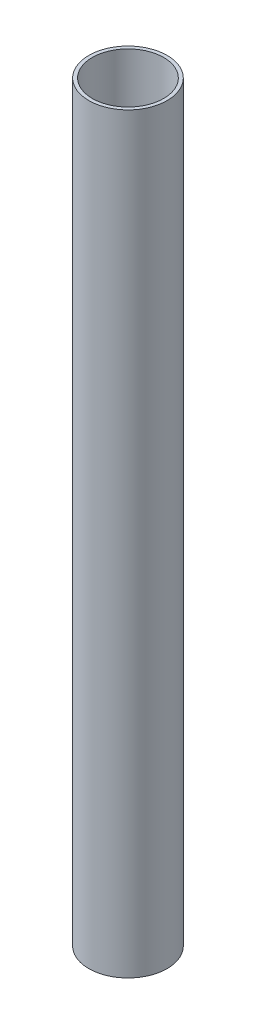
ISO-10303-21;
HEADER;
FILE_DESCRIPTION(('STEP AP214'),'2;1');
FILE_NAME('part.step','',(''),(''),'','','');
FILE_SCHEMA(('AUTOMOTIVE_DESIGN { 1 0 10303 214 1 1 1 1 }'));
ENDSEC;
DATA;
#1=APPLICATION_CONTEXT('core data for automotive mechanical design processes');
#2=APPLICATION_PROTOCOL_DEFINITION('international standard','automotive_design',2000,#1);
#3=PRODUCT_CONTEXT('',#1,'mechanical');
#4=PRODUCT('Part','Part','',(#3));
#5=PRODUCT_RELATED_PRODUCT_CATEGORY('part','',(#4));
#6=PRODUCT_DEFINITION_FORMATION('','',#4);
#7=PRODUCT_DEFINITION_CONTEXT('part definition',#1,'design');
#8=PRODUCT_DEFINITION('design','',#6,#7);
#9=PRODUCT_DEFINITION_SHAPE('','',#8);
#10=(LENGTH_UNIT() NAMED_UNIT(*) SI_UNIT(.MILLI.,.METRE.));
#11=(NAMED_UNIT(*) PLANE_ANGLE_UNIT() SI_UNIT($,.RADIAN.));
#12=(NAMED_UNIT(*) SI_UNIT($,.STERADIAN.) SOLID_ANGLE_UNIT());
#13=UNCERTAINTY_MEASURE_WITH_UNIT(LENGTH_MEASURE(1.E-05),#10,'distance_accuracy_value','');
#14=(GEOMETRIC_REPRESENTATION_CONTEXT(3) GLOBAL_UNCERTAINTY_ASSIGNED_CONTEXT((#13)) GLOBAL_UNIT_ASSIGNED_CONTEXT((#10,
#11,#12)) REPRESENTATION_CONTEXT('',''));
#15=CARTESIAN_POINT('',(0.,0.,0.));
#16=DIRECTION('',(0.,0.,1.));
#17=DIRECTION('',(1.,0.,0.));
#18=AXIS2_PLACEMENT_3D('',#15,#16,#17);
#19=CARTESIAN_POINT('',(0.,152.4,0.));
#20=DIRECTION('',(0.,1.,0.));
#21=DIRECTION('',(0.,0.,1.));
#22=AXIS2_PLACEMENT_3D('',#19,#20,#21);
#23=PLANE('',#22);
#24=CARTESIAN_POINT('',(0.,152.4,0.));
#25=DIRECTION('',(0.,1.,0.));
#26=DIRECTION('',(0.,0.,1.));
#27=AXIS2_PLACEMENT_3D('',#24,#25,#26);
#28=CIRCLE('',#27,7.9375);
#29=CARTESIAN_POINT('',(0.,152.4,7.9375));
#30=VERTEX_POINT('',#29);
#31=EDGE_CURVE('E10',#30,#30,#28,.T.);
#32=ORIENTED_EDGE('',*,*,#31,.T.);
#33=EDGE_LOOP('',(#32));
#34=FACE_BOUND('',#33,.T.);
#35=CARTESIAN_POINT('',(0.,152.4,0.));
#36=DIRECTION('',(0.,1.,0.));
#37=DIRECTION('',(0.,0.,1.));
#38=AXIS2_PLACEMENT_3D('',#35,#36,#37);
#39=CIRCLE('',#38,7.2263);
#40=CARTESIAN_POINT('',(0.,152.4,7.2263));
#41=VERTEX_POINT('',#40);
#42=EDGE_CURVE('E42',#41,#41,#39,.T.);
#43=ORIENTED_EDGE('',*,*,#42,.F.);
#44=EDGE_LOOP('',(#43));
#45=FACE_BOUND('',#44,.T.);
#46=ADVANCED_FACE('F31',(#34,#45),#23,.T.);
#47=CARTESIAN_POINT('',(0.,0.,0.));
#48=DIRECTION('',(0.,1.,0.));
#49=DIRECTION('',(0.,0.,1.));
#50=AXIS2_PLACEMENT_3D('',#47,#48,#49);
#51=PLANE('',#50);
#52=CARTESIAN_POINT('',(0.,0.,0.));
#53=DIRECTION('',(0.,1.,0.));
#54=DIRECTION('',(0.,0.,1.));
#55=AXIS2_PLACEMENT_3D('',#52,#53,#54);
#56=CIRCLE('',#55,7.9375);
#57=CARTESIAN_POINT('',(0.,0.,7.9375));
#58=VERTEX_POINT('',#57);
#59=EDGE_CURVE('E35',#58,#58,#56,.T.);
#60=ORIENTED_EDGE('',*,*,#59,.F.);
#61=EDGE_LOOP('',(#60));
#62=FACE_BOUND('',#61,.T.);
#63=CARTESIAN_POINT('',(0.,0.,0.));
#64=DIRECTION('',(0.,1.,0.));
#65=DIRECTION('',(0.,0.,1.));
#66=AXIS2_PLACEMENT_3D('',#63,#64,#65);
#67=CIRCLE('',#66,7.2263);
#68=CARTESIAN_POINT('',(0.,0.,7.2263));
#69=VERTEX_POINT('',#68);
#70=EDGE_CURVE('E44',#69,#69,#67,.T.);
#71=ORIENTED_EDGE('',*,*,#70,.T.);
#72=EDGE_LOOP('',(#71));
#73=FACE_BOUND('',#72,.T.);
#74=ADVANCED_FACE('F54',(#62,#73),#51,.F.);
#75=CARTESIAN_POINT('',(0.,152.4,0.));
#76=DIRECTION('',(0.,-1.,0.));
#77=DIRECTION('',(0.,0.,-1.));
#78=AXIS2_PLACEMENT_3D('',#75,#76,#77);
#79=CYLINDRICAL_SURFACE('',#78,7.9375);
#80=ORIENTED_EDGE('',*,*,#31,.F.);
#81=EDGE_LOOP('',(#80));
#82=FACE_BOUND('',#81,.T.);
#83=ORIENTED_EDGE('',*,*,#59,.T.);
#84=EDGE_LOOP('',(#83));
#85=FACE_BOUND('',#84,.T.);
#86=ADVANCED_FACE('F33',(#82,#85),#79,.T.);
#87=CARTESIAN_POINT('',(0.,152.4,0.));
#88=DIRECTION('',(0.,-1.,0.));
#89=DIRECTION('',(0.,0.,-1.));
#90=AXIS2_PLACEMENT_3D('',#87,#88,#89);
#91=CYLINDRICAL_SURFACE('',#90,7.2263);
#92=ORIENTED_EDGE('',*,*,#42,.T.);
#93=EDGE_LOOP('',(#92));
#94=FACE_BOUND('',#93,.T.);
#95=ORIENTED_EDGE('',*,*,#70,.F.);
#96=EDGE_LOOP('',(#95));
#97=FACE_BOUND('',#96,.T.);
#98=ADVANCED_FACE('F50',(#94,#97),#91,.F.);
#99=CLOSED_SHELL('',(#46,#74,#86,#98));
#100=MANIFOLD_SOLID_BREP('B2',#99);
#101=ADVANCED_BREP_SHAPE_REPRESENTATION('',(#18,#100),#14);
#102=SHAPE_DEFINITION_REPRESENTATION(#9,#101);
ENDSEC;
END-ISO-10303-21;
